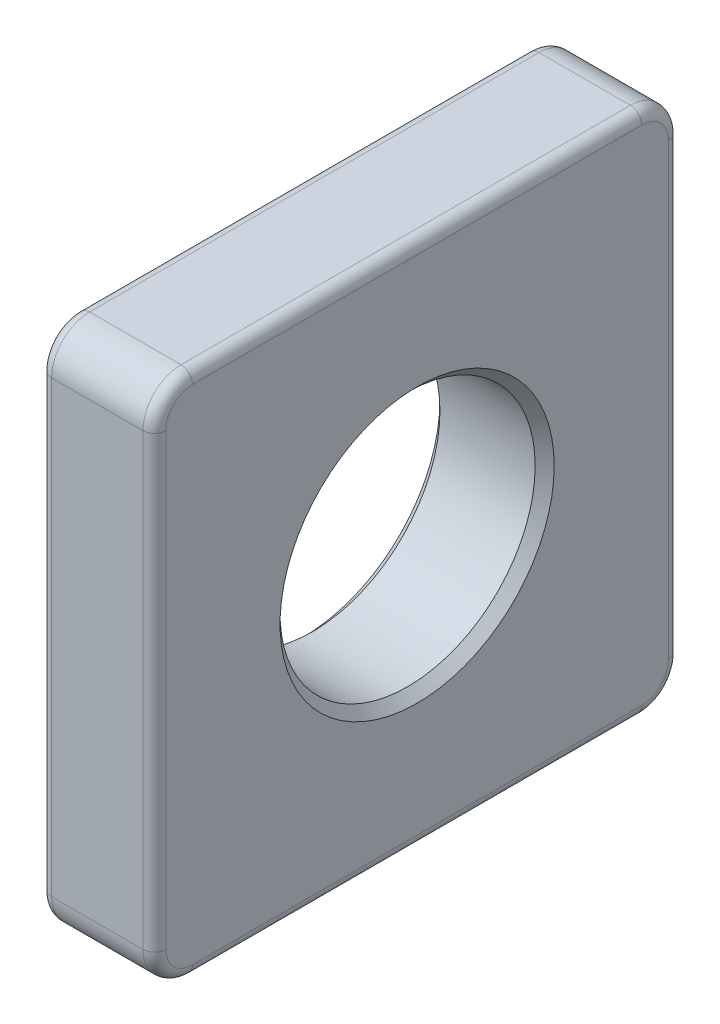
ISO-10303-21;
HEADER;
FILE_DESCRIPTION(('STEP AP214'),'2;1');
FILE_NAME('part.step','',(''),(''),'','','');
FILE_SCHEMA(('AUTOMOTIVE_DESIGN { 1 0 10303 214 1 1 1 1 }'));
ENDSEC;
DATA;
#1=APPLICATION_CONTEXT('core data for automotive mechanical design processes');
#2=APPLICATION_PROTOCOL_DEFINITION('international standard','automotive_design',2000,#1);
#3=PRODUCT_CONTEXT('',#1,'mechanical');
#4=PRODUCT('Part','Part','',(#3));
#5=PRODUCT_RELATED_PRODUCT_CATEGORY('part','',(#4));
#6=PRODUCT_DEFINITION_FORMATION('','',#4);
#7=PRODUCT_DEFINITION_CONTEXT('part definition',#1,'design');
#8=PRODUCT_DEFINITION('design','',#6,#7);
#9=PRODUCT_DEFINITION_SHAPE('','',#8);
#10=(LENGTH_UNIT() NAMED_UNIT(*) SI_UNIT(.MILLI.,.METRE.));
#11=(NAMED_UNIT(*) PLANE_ANGLE_UNIT() SI_UNIT($,.RADIAN.));
#12=(NAMED_UNIT(*) SI_UNIT($,.STERADIAN.) SOLID_ANGLE_UNIT());
#13=UNCERTAINTY_MEASURE_WITH_UNIT(LENGTH_MEASURE(1.E-05),#10,'distance_accuracy_value','');
#14=(GEOMETRIC_REPRESENTATION_CONTEXT(3) GLOBAL_UNCERTAINTY_ASSIGNED_CONTEXT((#13)) GLOBAL_UNIT_ASSIGNED_CONTEXT((#10,
#11,#12)) REPRESENTATION_CONTEXT('',''));
#15=CARTESIAN_POINT('',(0.,0.,0.));
#16=DIRECTION('',(0.,0.,1.));
#17=DIRECTION('',(1.,0.,0.));
#18=AXIS2_PLACEMENT_3D('',#15,#16,#17);
#19=CARTESIAN_POINT('',(3.,-6.9,6.9));
#20=DIRECTION('',(0.,0.,-1.));
#21=DIRECTION('',(-1.,0.,0.));
#22=AXIS2_PLACEMENT_3D('',#19,#20,#21);
#23=PLANE('',#22);
#24=DIRECTION('',(-1.,0.,0.));
#25=VECTOR('',#24,1.);
#26=CARTESIAN_POINT('',(3.,-5.9,6.9));
#27=LINE('',#26,#25);
#28=CARTESIAN_POINT('',(0.3,-5.9,6.9));
#29=VERTEX_POINT('',#28);
#30=CARTESIAN_POINT('',(2.7,-5.9,6.9));
#31=VERTEX_POINT('',#30);
#32=EDGE_CURVE('E187',#29,#31,#27,.F.);
#33=ORIENTED_EDGE('',*,*,#32,.T.);
#34=DIRECTION('',(0.,-1.,0.));
#35=VECTOR('',#34,1.);
#36=CARTESIAN_POINT('',(2.7,5.9,6.9));
#37=LINE('',#36,#35);
#38=CARTESIAN_POINT('',(2.7,5.9,6.9));
#39=VERTEX_POINT('',#38);
#40=EDGE_CURVE('E11',#31,#39,#37,.F.);
#41=ORIENTED_EDGE('',*,*,#40,.T.);
#42=DIRECTION('',(-1.,0.,0.));
#43=VECTOR('',#42,1.);
#44=CARTESIAN_POINT('',(3.,5.9,6.9));
#45=LINE('',#44,#43);
#46=CARTESIAN_POINT('',(0.3,5.9,6.9));
#47=VERTEX_POINT('',#46);
#48=EDGE_CURVE('E191',#39,#47,#45,.T.);
#49=ORIENTED_EDGE('',*,*,#48,.T.);
#50=DIRECTION('',(0.,-1.,0.));
#51=VECTOR('',#50,1.);
#52=CARTESIAN_POINT('',(0.3,-6.9,6.9));
#53=LINE('',#52,#51);
#54=EDGE_CURVE('E53',#47,#29,#53,.T.);
#55=ORIENTED_EDGE('',*,*,#54,.T.);
#56=EDGE_LOOP('',(#33,#41,#49,#55));
#57=FACE_BOUND('',#56,.T.);
#58=ADVANCED_FACE('F43',(#57),#23,.F.);
#59=CARTESIAN_POINT('',(3.,-6.9,-6.9));
#60=DIRECTION('',(0.,1.,0.));
#61=DIRECTION('',(0.,0.,1.));
#62=AXIS2_PLACEMENT_3D('',#59,#60,#61);
#63=PLANE('',#62);
#64=DIRECTION('',(-1.,0.,0.));
#65=VECTOR('',#64,1.);
#66=CARTESIAN_POINT('',(3.,-6.9,5.9));
#67=LINE('',#66,#65);
#68=CARTESIAN_POINT('',(2.7,-6.9,5.9));
#69=VERTEX_POINT('',#68);
#70=CARTESIAN_POINT('',(0.3,-6.9,5.9));
#71=VERTEX_POINT('',#70);
#72=EDGE_CURVE('E356',#69,#71,#67,.T.);
#73=ORIENTED_EDGE('',*,*,#72,.T.);
#74=DIRECTION('',(0.,0.,-1.));
#75=VECTOR('',#74,1.);
#76=CARTESIAN_POINT('',(0.3,-6.9,-6.9));
#77=LINE('',#76,#75);
#78=CARTESIAN_POINT('',(0.3,-6.9,-5.9));
#79=VERTEX_POINT('',#78);
#80=EDGE_CURVE('E246',#71,#79,#77,.T.);
#81=ORIENTED_EDGE('',*,*,#80,.T.);
#82=DIRECTION('',(-1.,0.,0.));
#83=VECTOR('',#82,1.);
#84=CARTESIAN_POINT('',(3.,-6.9,-5.9));
#85=LINE('',#84,#83);
#86=CARTESIAN_POINT('',(2.7,-6.9,-5.9));
#87=VERTEX_POINT('',#86);
#88=EDGE_CURVE('E362',#79,#87,#85,.F.);
#89=ORIENTED_EDGE('',*,*,#88,.T.);
#90=DIRECTION('',(0.,0.,-1.));
#91=VECTOR('',#90,1.);
#92=CARTESIAN_POINT('',(2.7,-6.9,5.9));
#93=LINE('',#92,#91);
#94=EDGE_CURVE('E243',#87,#69,#93,.F.);
#95=ORIENTED_EDGE('',*,*,#94,.T.);
#96=EDGE_LOOP('',(#73,#81,#89,#95));
#97=FACE_BOUND('',#96,.T.);
#98=ADVANCED_FACE('F404',(#97),#63,.F.);
#99=CARTESIAN_POINT('',(3.,-6.9,-6.9));
#100=DIRECTION('',(0.,0.,1.));
#101=DIRECTION('',(1.,0.,0.));
#102=AXIS2_PLACEMENT_3D('',#99,#100,#101);
#103=PLANE('',#102);
#104=DIRECTION('',(-1.,0.,0.));
#105=VECTOR('',#104,1.);
#106=CARTESIAN_POINT('',(3.,-5.9,-6.9));
#107=LINE('',#106,#105);
#108=CARTESIAN_POINT('',(2.7,-5.9,-6.9));
#109=VERTEX_POINT('',#108);
#110=CARTESIAN_POINT('',(0.3,-5.9,-6.9));
#111=VERTEX_POINT('',#110);
#112=EDGE_CURVE('E357',#109,#111,#107,.T.);
#113=ORIENTED_EDGE('',*,*,#112,.T.);
#114=DIRECTION('',(0.,1.,0.));
#115=VECTOR('',#114,1.);
#116=CARTESIAN_POINT('',(0.3,-6.9,-6.9));
#117=LINE('',#116,#115);
#118=CARTESIAN_POINT('',(0.3,5.9,-6.9));
#119=VERTEX_POINT('',#118);
#120=EDGE_CURVE('E234',#111,#119,#117,.T.);
#121=ORIENTED_EDGE('',*,*,#120,.T.);
#122=DIRECTION('',(-1.,0.,0.));
#123=VECTOR('',#122,1.);
#124=CARTESIAN_POINT('',(3.,5.9,-6.9));
#125=LINE('',#124,#123);
#126=CARTESIAN_POINT('',(2.7,5.9,-6.9));
#127=VERTEX_POINT('',#126);
#128=EDGE_CURVE('E346',#119,#127,#125,.F.);
#129=ORIENTED_EDGE('',*,*,#128,.T.);
#130=DIRECTION('',(0.,1.,0.));
#131=VECTOR('',#130,1.);
#132=CARTESIAN_POINT('',(2.7,-5.9,-6.9));
#133=LINE('',#132,#131);
#134=EDGE_CURVE('E231',#127,#109,#133,.F.);
#135=ORIENTED_EDGE('',*,*,#134,.T.);
#136=EDGE_LOOP('',(#113,#121,#129,#135));
#137=FACE_BOUND('',#136,.T.);
#138=ADVANCED_FACE('F352',(#137),#103,.F.);
#139=CARTESIAN_POINT('',(3.,6.9,-6.9));
#140=DIRECTION('',(0.,-1.,0.));
#141=DIRECTION('',(0.,0.,-1.));
#142=AXIS2_PLACEMENT_3D('',#139,#140,#141);
#143=PLANE('',#142);
#144=DIRECTION('',(-1.,0.,0.));
#145=VECTOR('',#144,1.);
#146=CARTESIAN_POINT('',(3.,6.9,-5.9));
#147=LINE('',#146,#145);
#148=CARTESIAN_POINT('',(2.7,6.9,-5.9));
#149=VERTEX_POINT('',#148);
#150=CARTESIAN_POINT('',(0.3,6.9,-5.9));
#151=VERTEX_POINT('',#150);
#152=EDGE_CURVE('E349',#149,#151,#147,.T.);
#153=ORIENTED_EDGE('',*,*,#152,.T.);
#154=DIRECTION('',(0.,0.,1.));
#155=VECTOR('',#154,1.);
#156=CARTESIAN_POINT('',(0.3,6.9,-6.9));
#157=LINE('',#156,#155);
#158=CARTESIAN_POINT('',(0.3,6.9,5.9));
#159=VERTEX_POINT('',#158);
#160=EDGE_CURVE('E222',#151,#159,#157,.T.);
#161=ORIENTED_EDGE('',*,*,#160,.T.);
#162=DIRECTION('',(-1.,0.,0.));
#163=VECTOR('',#162,1.);
#164=CARTESIAN_POINT('',(3.,6.9,5.9));
#165=LINE('',#164,#163);
#166=CARTESIAN_POINT('',(2.7,6.9,5.9));
#167=VERTEX_POINT('',#166);
#168=EDGE_CURVE('E630',#159,#167,#165,.F.);
#169=ORIENTED_EDGE('',*,*,#168,.T.);
#170=DIRECTION('',(0.,0.,1.));
#171=VECTOR('',#170,1.);
#172=CARTESIAN_POINT('',(2.7,6.9,-5.9));
#173=LINE('',#172,#171);
#174=EDGE_CURVE('E219',#167,#149,#173,.F.);
#175=ORIENTED_EDGE('',*,*,#174,.T.);
#176=EDGE_LOOP('',(#153,#161,#169,#175));
#177=FACE_BOUND('',#176,.T.);
#178=ADVANCED_FACE('F629',(#177),#143,.F.);
#179=CARTESIAN_POINT('',(3.,0.,0.));
#180=DIRECTION('',(1.,0.,0.));
#181=DIRECTION('',(0.,0.,-1.));
#182=AXIS2_PLACEMENT_3D('',#179,#180,#181);
#183=PLANE('',#182);
#184=DIRECTION('',(0.,-1.,0.));
#185=VECTOR('',#184,1.);
#186=CARTESIAN_POINT('',(3.,-5.9,6.6));
#187=LINE('',#186,#185);
#188=CARTESIAN_POINT('',(3.,5.9,6.6));
#189=VERTEX_POINT('',#188);
#190=CARTESIAN_POINT('',(3.,-5.9,6.6));
#191=VERTEX_POINT('',#190);
#192=EDGE_CURVE('E61',#189,#191,#187,.T.);
#193=ORIENTED_EDGE('',*,*,#192,.T.);
#194=CARTESIAN_POINT('',(3.,-5.9,5.9));
#195=DIRECTION('',(1.,0.,0.));
#196=DIRECTION('',(0.,0.,-1.));
#197=AXIS2_PLACEMENT_3D('',#194,#195,#196);
#198=CIRCLE('',#197,0.7);
#199=CARTESIAN_POINT('',(3.,-6.6,5.9));
#200=VERTEX_POINT('',#199);
#201=EDGE_CURVE('E274',#191,#200,#198,.T.);
#202=ORIENTED_EDGE('',*,*,#201,.T.);
#203=DIRECTION('',(0.,0.,-1.));
#204=VECTOR('',#203,1.);
#205=CARTESIAN_POINT('',(3.,-6.6,-5.9));
#206=LINE('',#205,#204);
#207=CARTESIAN_POINT('',(3.,-6.6,-5.9));
#208=VERTEX_POINT('',#207);
#209=EDGE_CURVE('E255',#200,#208,#206,.T.);
#210=ORIENTED_EDGE('',*,*,#209,.T.);
#211=CARTESIAN_POINT('',(3.,-5.9,-5.9));
#212=DIRECTION('',(1.,0.,0.));
#213=DIRECTION('',(0.,0.,-1.));
#214=AXIS2_PLACEMENT_3D('',#211,#212,#213);
#215=CIRCLE('',#214,0.7);
#216=CARTESIAN_POINT('',(3.,-5.9,-6.6));
#217=VERTEX_POINT('',#216);
#218=EDGE_CURVE('E258',#208,#217,#215,.T.);
#219=ORIENTED_EDGE('',*,*,#218,.T.);
#220=DIRECTION('',(0.,1.,0.));
#221=VECTOR('',#220,1.);
#222=CARTESIAN_POINT('',(3.,5.9,-6.6));
#223=LINE('',#222,#221);
#224=CARTESIAN_POINT('',(3.,5.9,-6.6));
#225=VERTEX_POINT('',#224);
#226=EDGE_CURVE('E261',#217,#225,#223,.T.);
#227=ORIENTED_EDGE('',*,*,#226,.T.);
#228=CARTESIAN_POINT('',(3.,5.9,-5.9));
#229=DIRECTION('',(1.,0.,0.));
#230=DIRECTION('',(0.,0.,-1.));
#231=AXIS2_PLACEMENT_3D('',#228,#229,#230);
#232=CIRCLE('',#231,0.7);
#233=CARTESIAN_POINT('',(3.,6.6,-5.9));
#234=VERTEX_POINT('',#233);
#235=EDGE_CURVE('E264',#225,#234,#232,.T.);
#236=ORIENTED_EDGE('',*,*,#235,.T.);
#237=DIRECTION('',(0.,0.,1.));
#238=VECTOR('',#237,1.);
#239=CARTESIAN_POINT('',(3.,6.6,5.9));
#240=LINE('',#239,#238);
#241=CARTESIAN_POINT('',(3.,6.6,5.9));
#242=VERTEX_POINT('',#241);
#243=EDGE_CURVE('E267',#234,#242,#240,.T.);
#244=ORIENTED_EDGE('',*,*,#243,.T.);
#245=CARTESIAN_POINT('',(3.,5.9,5.9));
#246=DIRECTION('',(1.,0.,0.));
#247=DIRECTION('',(0.,0.,-1.));
#248=AXIS2_PLACEMENT_3D('',#245,#246,#247);
#249=CIRCLE('',#248,0.7);
#250=EDGE_CURVE('E66',#242,#189,#249,.T.);
#251=ORIENTED_EDGE('',*,*,#250,.T.);
#252=EDGE_LOOP('',(#193,#202,#210,#219,#227,#236,#244,#251));
#253=FACE_BOUND('',#252,.T.);
#254=CARTESIAN_POINT('',(3.,0.,0.));
#255=DIRECTION('',(1.,0.,0.));
#256=DIRECTION('',(0.,0.,-1.));
#257=AXIS2_PLACEMENT_3D('',#254,#255,#256);
#258=CIRCLE('',#257,3.6);
#259=CARTESIAN_POINT('',(3.,0.,-3.6));
#260=VERTEX_POINT('',#259);
#261=EDGE_CURVE('E632',#260,#260,#258,.F.);
#262=ORIENTED_EDGE('',*,*,#261,.T.);
#263=EDGE_LOOP('',(#262));
#264=FACE_BOUND('',#263,.T.);
#265=ADVANCED_FACE('F391',(#253,#264),#183,.T.);
#266=CARTESIAN_POINT('',(0.,0.,0.));
#267=DIRECTION('',(1.,0.,0.));
#268=DIRECTION('',(0.,0.,-1.));
#269=AXIS2_PLACEMENT_3D('',#266,#267,#268);
#270=PLANE('',#269);
#271=DIRECTION('',(0.,-1.,0.));
#272=VECTOR('',#271,1.);
#273=CARTESIAN_POINT('',(0.,0.,6.6));
#274=LINE('',#273,#272);
#275=CARTESIAN_POINT('',(0.,-5.9,6.6));
#276=VERTEX_POINT('',#275);
#277=CARTESIAN_POINT('',(0.,5.9,6.6));
#278=VERTEX_POINT('',#277);
#279=EDGE_CURVE('E163',#276,#278,#274,.F.);
#280=ORIENTED_EDGE('',*,*,#279,.T.);
#281=CARTESIAN_POINT('',(0.,5.9,5.9));
#282=DIRECTION('',(1.,0.,0.));
#283=DIRECTION('',(0.,0.,-1.));
#284=AXIS2_PLACEMENT_3D('',#281,#282,#283);
#285=CIRCLE('',#284,0.7);
#286=CARTESIAN_POINT('',(0.,6.6,5.9));
#287=VERTEX_POINT('',#286);
#288=EDGE_CURVE('E209',#278,#287,#285,.F.);
#289=ORIENTED_EDGE('',*,*,#288,.T.);
#290=DIRECTION('',(0.,0.,1.));
#291=VECTOR('',#290,1.);
#292=CARTESIAN_POINT('',(0.,6.6,0.));
#293=LINE('',#292,#291);
#294=CARTESIAN_POINT('',(0.,6.6,-5.9));
#295=VERTEX_POINT('',#294);
#296=EDGE_CURVE('E206',#287,#295,#293,.F.);
#297=ORIENTED_EDGE('',*,*,#296,.T.);
#298=CARTESIAN_POINT('',(0.,5.9,-5.9));
#299=DIRECTION('',(1.,0.,0.));
#300=DIRECTION('',(0.,0.,-1.));
#301=AXIS2_PLACEMENT_3D('',#298,#299,#300);
#302=CIRCLE('',#301,0.7);
#303=CARTESIAN_POINT('',(0.,5.9,-6.6));
#304=VERTEX_POINT('',#303);
#305=EDGE_CURVE('E203',#295,#304,#302,.F.);
#306=ORIENTED_EDGE('',*,*,#305,.T.);
#307=DIRECTION('',(0.,1.,0.));
#308=VECTOR('',#307,1.);
#309=CARTESIAN_POINT('',(0.,0.,-6.6));
#310=LINE('',#309,#308);
#311=CARTESIAN_POINT('',(0.,-5.9,-6.6));
#312=VERTEX_POINT('',#311);
#313=EDGE_CURVE('E200',#304,#312,#310,.F.);
#314=ORIENTED_EDGE('',*,*,#313,.T.);
#315=CARTESIAN_POINT('',(0.,-5.9,-5.9));
#316=DIRECTION('',(1.,0.,0.));
#317=DIRECTION('',(0.,0.,-1.));
#318=AXIS2_PLACEMENT_3D('',#315,#316,#317);
#319=CIRCLE('',#318,0.7);
#320=CARTESIAN_POINT('',(0.,-6.6,-5.9));
#321=VERTEX_POINT('',#320);
#322=EDGE_CURVE('E197',#312,#321,#319,.F.);
#323=ORIENTED_EDGE('',*,*,#322,.T.);
#324=DIRECTION('',(0.,0.,-1.));
#325=VECTOR('',#324,1.);
#326=CARTESIAN_POINT('',(0.,-6.6,0.));
#327=LINE('',#326,#325);
#328=CARTESIAN_POINT('',(0.,-6.6,5.9));
#329=VERTEX_POINT('',#328);
#330=EDGE_CURVE('E166',#321,#329,#327,.F.);
#331=ORIENTED_EDGE('',*,*,#330,.T.);
#332=CARTESIAN_POINT('',(0.,-5.9,5.9));
#333=DIRECTION('',(1.,0.,0.));
#334=DIRECTION('',(0.,0.,-1.));
#335=AXIS2_PLACEMENT_3D('',#332,#333,#334);
#336=CIRCLE('',#335,0.7);
#337=EDGE_CURVE('E157',#329,#276,#336,.F.);
#338=ORIENTED_EDGE('',*,*,#337,.T.);
#339=EDGE_LOOP('',(#280,#289,#297,#306,#314,#323,#331,#338));
#340=FACE_BOUND('',#339,.T.);
#341=CARTESIAN_POINT('',(0.,0.,0.));
#342=DIRECTION('',(1.,0.,0.));
#343=DIRECTION('',(0.,0.,-1.));
#344=AXIS2_PLACEMENT_3D('',#341,#342,#343);
#345=CIRCLE('',#344,3.6);
#346=CARTESIAN_POINT('',(0.,0.,-3.6));
#347=VERTEX_POINT('',#346);
#348=EDGE_CURVE('E301',#347,#347,#345,.T.);
#349=ORIENTED_EDGE('',*,*,#348,.T.);
#350=EDGE_LOOP('',(#349));
#351=FACE_BOUND('',#350,.T.);
#352=ADVANCED_FACE('F159',(#340,#351),#270,.F.);
#353=CARTESIAN_POINT('',(3.,0.,0.));
#354=DIRECTION('',(-1.,0.,0.));
#355=DIRECTION('',(0.,0.,1.));
#356=AXIS2_PLACEMENT_3D('',#353,#354,#355);
#357=CYLINDRICAL_SURFACE('',#356,3.35);
#358=CARTESIAN_POINT('',(0.249999999999999,0.,0.));
#359=DIRECTION('',(1.,0.,0.));
#360=DIRECTION('',(0.,0.,-1.));
#361=AXIS2_PLACEMENT_3D('',#358,#359,#360);
#362=CIRCLE('',#361,3.35);
#363=CARTESIAN_POINT('',(0.249999999999999,0.,-3.35));
#364=VERTEX_POINT('',#363);
#365=EDGE_CURVE('E637',#364,#364,#362,.F.);
#366=ORIENTED_EDGE('',*,*,#365,.T.);
#367=EDGE_LOOP('',(#366));
#368=FACE_BOUND('',#367,.T.);
#369=CARTESIAN_POINT('',(2.75,0.,0.));
#370=DIRECTION('',(1.,0.,0.));
#371=DIRECTION('',(0.,0.,-1.));
#372=AXIS2_PLACEMENT_3D('',#369,#370,#371);
#373=CIRCLE('',#372,3.35);
#374=CARTESIAN_POINT('',(2.75,0.,-3.35));
#375=VERTEX_POINT('',#374);
#376=EDGE_CURVE('E643',#375,#375,#373,.T.);
#377=ORIENTED_EDGE('',*,*,#376,.T.);
#378=EDGE_LOOP('',(#377));
#379=FACE_BOUND('',#378,.T.);
#380=ADVANCED_FACE('F436',(#368,#379),#357,.F.);
#381=CARTESIAN_POINT('',(0.,0.,0.));
#382=DIRECTION('',(-1.,0.,0.));
#383=DIRECTION('',(0.,0.,1.));
#384=AXIS2_PLACEMENT_3D('',#381,#382,#383);
#385=CONICAL_SURFACE('',#384,3.6,0.785398163397444);
#386=ORIENTED_EDGE('',*,*,#365,.F.);
#387=EDGE_LOOP('',(#386));
#388=FACE_BOUND('',#387,.T.);
#389=ORIENTED_EDGE('',*,*,#348,.F.);
#390=EDGE_LOOP('',(#389));
#391=FACE_BOUND('',#390,.T.);
#392=ADVANCED_FACE('F429',(#388,#391),#385,.F.);
#393=CARTESIAN_POINT('',(2.75,0.,0.));
#394=DIRECTION('',(1.,0.,0.));
#395=DIRECTION('',(0.,0.,-1.));
#396=AXIS2_PLACEMENT_3D('',#393,#394,#395);
#397=CONICAL_SURFACE('',#396,3.35,0.785398163397456);
#398=ORIENTED_EDGE('',*,*,#261,.F.);
#399=EDGE_LOOP('',(#398));
#400=FACE_BOUND('',#399,.T.);
#401=ORIENTED_EDGE('',*,*,#376,.F.);
#402=EDGE_LOOP('',(#401));
#403=FACE_BOUND('',#402,.T.);
#404=ADVANCED_FACE('F435',(#400,#403),#397,.F.);
#405=CARTESIAN_POINT('',(3.,5.9,-5.9));
#406=DIRECTION('',(-1.,0.,0.));
#407=DIRECTION('',(0.,0.,1.));
#408=AXIS2_PLACEMENT_3D('',#405,#406,#407);
#409=CYLINDRICAL_SURFACE('',#408,1.);
#410=ORIENTED_EDGE('',*,*,#128,.F.);
#411=CARTESIAN_POINT('',(0.3,5.9,-5.9));
#412=DIRECTION('',(1.,0.,0.));
#413=DIRECTION('',(0.,0.,-1.));
#414=AXIS2_PLACEMENT_3D('',#411,#412,#413);
#415=CIRCLE('',#414,1.);
#416=EDGE_CURVE('E228',#119,#151,#415,.T.);
#417=ORIENTED_EDGE('',*,*,#416,.T.);
#418=ORIENTED_EDGE('',*,*,#152,.F.);
#419=CARTESIAN_POINT('',(2.7,5.9,-5.9));
#420=DIRECTION('',(1.,0.,0.));
#421=DIRECTION('',(0.,0.,-1.));
#422=AXIS2_PLACEMENT_3D('',#419,#420,#421);
#423=CIRCLE('',#422,1.);
#424=EDGE_CURVE('E225',#149,#127,#423,.F.);
#425=ORIENTED_EDGE('',*,*,#424,.T.);
#426=EDGE_LOOP('',(#410,#417,#418,#425));
#427=FACE_BOUND('',#426,.T.);
#428=ADVANCED_FACE('F345',(#427),#409,.T.);
#429=CARTESIAN_POINT('',(3.,-5.9,-5.9));
#430=DIRECTION('',(-1.,0.,0.));
#431=DIRECTION('',(0.,0.,1.));
#432=AXIS2_PLACEMENT_3D('',#429,#430,#431);
#433=CYLINDRICAL_SURFACE('',#432,1.);
#434=ORIENTED_EDGE('',*,*,#88,.F.);
#435=CARTESIAN_POINT('',(0.3,-5.9,-5.9));
#436=DIRECTION('',(1.,0.,0.));
#437=DIRECTION('',(0.,0.,-1.));
#438=AXIS2_PLACEMENT_3D('',#435,#436,#437);
#439=CIRCLE('',#438,1.);
#440=EDGE_CURVE('E240',#79,#111,#439,.T.);
#441=ORIENTED_EDGE('',*,*,#440,.T.);
#442=ORIENTED_EDGE('',*,*,#112,.F.);
#443=CARTESIAN_POINT('',(2.7,-5.9,-5.9));
#444=DIRECTION('',(1.,0.,0.));
#445=DIRECTION('',(0.,0.,-1.));
#446=AXIS2_PLACEMENT_3D('',#443,#444,#445);
#447=CIRCLE('',#446,1.);
#448=EDGE_CURVE('E237',#109,#87,#447,.F.);
#449=ORIENTED_EDGE('',*,*,#448,.T.);
#450=EDGE_LOOP('',(#434,#441,#442,#449));
#451=FACE_BOUND('',#450,.T.);
#452=ADVANCED_FACE('F410',(#451),#433,.T.);
#453=CARTESIAN_POINT('',(3.,-5.9,5.9));
#454=DIRECTION('',(-1.,0.,0.));
#455=DIRECTION('',(0.,0.,1.));
#456=AXIS2_PLACEMENT_3D('',#453,#454,#455);
#457=CYLINDRICAL_SURFACE('',#456,1.);
#458=ORIENTED_EDGE('',*,*,#32,.F.);
#459=CARTESIAN_POINT('',(0.3,-5.9,5.9));
#460=DIRECTION('',(1.,0.,0.));
#461=DIRECTION('',(0.,0.,-1.));
#462=AXIS2_PLACEMENT_3D('',#459,#460,#461);
#463=CIRCLE('',#462,1.);
#464=EDGE_CURVE('E176',#29,#71,#463,.T.);
#465=ORIENTED_EDGE('',*,*,#464,.T.);
#466=ORIENTED_EDGE('',*,*,#72,.F.);
#467=CARTESIAN_POINT('',(2.7,-5.9,5.9));
#468=DIRECTION('',(1.,0.,0.));
#469=DIRECTION('',(0.,0.,-1.));
#470=AXIS2_PLACEMENT_3D('',#467,#468,#469);
#471=CIRCLE('',#470,1.);
#472=EDGE_CURVE('E249',#69,#31,#471,.F.);
#473=ORIENTED_EDGE('',*,*,#472,.T.);
#474=EDGE_LOOP('',(#458,#465,#466,#473));
#475=FACE_BOUND('',#474,.T.);
#476=ADVANCED_FACE('F408',(#475),#457,.T.);
#477=CARTESIAN_POINT('',(3.,5.9,5.9));
#478=DIRECTION('',(-1.,0.,0.));
#479=DIRECTION('',(0.,0.,1.));
#480=AXIS2_PLACEMENT_3D('',#477,#478,#479);
#481=CYLINDRICAL_SURFACE('',#480,1.);
#482=ORIENTED_EDGE('',*,*,#168,.F.);
#483=CARTESIAN_POINT('',(0.3,5.9,5.9));
#484=DIRECTION('',(1.,0.,0.));
#485=DIRECTION('',(0.,0.,-1.));
#486=AXIS2_PLACEMENT_3D('',#483,#484,#485);
#487=CIRCLE('',#486,1.);
#488=EDGE_CURVE('E215',#159,#47,#487,.T.);
#489=ORIENTED_EDGE('',*,*,#488,.T.);
#490=ORIENTED_EDGE('',*,*,#48,.F.);
#491=CARTESIAN_POINT('',(2.7,5.9,5.9));
#492=DIRECTION('',(1.,0.,0.));
#493=DIRECTION('',(0.,0.,-1.));
#494=AXIS2_PLACEMENT_3D('',#491,#492,#493);
#495=CIRCLE('',#494,1.);
#496=EDGE_CURVE('E212',#39,#167,#495,.F.);
#497=ORIENTED_EDGE('',*,*,#496,.T.);
#498=EDGE_LOOP('',(#482,#489,#490,#497));
#499=FACE_BOUND('',#498,.T.);
#500=ADVANCED_FACE('F378',(#499),#481,.T.);
#501=CARTESIAN_POINT('',(0.3,-5.9,-5.9));
#502=DIRECTION('',(1.,0.,0.));
#503=DIRECTION('',(0.,0.,-1.));
#504=AXIS2_PLACEMENT_3D('',#501,#502,#503);
#505=TOROIDAL_SURFACE('',#504,0.7,0.3);
#506=CARTESIAN_POINT('',(0.3,-5.9,-6.6));
#507=DIRECTION('',(0.,1.,0.));
#508=DIRECTION('',(0.,0.,1.));
#509=AXIS2_PLACEMENT_3D('',#506,#507,#508);
#510=CIRCLE('',#509,0.3);
#511=EDGE_CURVE('E293',#111,#312,#510,.T.);
#512=ORIENTED_EDGE('',*,*,#511,.F.);
#513=ORIENTED_EDGE('',*,*,#440,.F.);
#514=CARTESIAN_POINT('',(0.3,-6.6,-5.9));
#515=DIRECTION('',(0.,0.,1.));
#516=DIRECTION('',(1.,0.,0.));
#517=AXIS2_PLACEMENT_3D('',#514,#515,#516);
#518=CIRCLE('',#517,0.3);
#519=EDGE_CURVE('E297',#321,#79,#518,.T.);
#520=ORIENTED_EDGE('',*,*,#519,.F.);
#521=ORIENTED_EDGE('',*,*,#322,.F.);
#522=EDGE_LOOP('',(#512,#513,#520,#521));
#523=FACE_BOUND('',#522,.T.);
#524=ADVANCED_FACE('F416',(#523),#505,.T.);
#525=CARTESIAN_POINT('',(0.3,-6.6,-6.9));
#526=DIRECTION('',(0.,0.,-1.));
#527=DIRECTION('',(0.,1.,0.));
#528=AXIS2_PLACEMENT_3D('',#525,#526,#527);
#529=CYLINDRICAL_SURFACE('',#528,0.3);
#530=ORIENTED_EDGE('',*,*,#519,.T.);
#531=ORIENTED_EDGE('',*,*,#80,.F.);
#532=CARTESIAN_POINT('',(0.3,-6.6,5.9));
#533=DIRECTION('',(0.,0.,1.));
#534=DIRECTION('',(1.,0.,0.));
#535=AXIS2_PLACEMENT_3D('',#532,#533,#534);
#536=CIRCLE('',#535,0.3);
#537=EDGE_CURVE('E290',#329,#71,#536,.T.);
#538=ORIENTED_EDGE('',*,*,#537,.F.);
#539=ORIENTED_EDGE('',*,*,#330,.F.);
#540=EDGE_LOOP('',(#530,#531,#538,#539));
#541=FACE_BOUND('',#540,.T.);
#542=ADVANCED_FACE('F472',(#541),#529,.T.);
#543=CARTESIAN_POINT('',(0.3,-6.9,-6.6));
#544=DIRECTION('',(0.,1.,0.));
#545=DIRECTION('',(0.,0.,1.));
#546=AXIS2_PLACEMENT_3D('',#543,#544,#545);
#547=CYLINDRICAL_SURFACE('',#546,0.3);
#548=ORIENTED_EDGE('',*,*,#511,.T.);
#549=ORIENTED_EDGE('',*,*,#313,.F.);
#550=CARTESIAN_POINT('',(0.3,5.9,-6.6));
#551=DIRECTION('',(0.,1.,0.));
#552=DIRECTION('',(0.,0.,1.));
#553=AXIS2_PLACEMENT_3D('',#550,#551,#552);
#554=CIRCLE('',#553,0.3);
#555=EDGE_CURVE('E180',#119,#304,#554,.T.);
#556=ORIENTED_EDGE('',*,*,#555,.F.);
#557=ORIENTED_EDGE('',*,*,#120,.F.);
#558=EDGE_LOOP('',(#548,#549,#556,#557));
#559=FACE_BOUND('',#558,.T.);
#560=ADVANCED_FACE('F483',(#559),#547,.T.);
#561=CARTESIAN_POINT('',(0.3,-5.9,5.9));
#562=DIRECTION('',(1.,0.,0.));
#563=DIRECTION('',(0.,0.,-1.));
#564=AXIS2_PLACEMENT_3D('',#561,#562,#563);
#565=TOROIDAL_SURFACE('',#564,0.7,0.3);
#566=ORIENTED_EDGE('',*,*,#537,.T.);
#567=ORIENTED_EDGE('',*,*,#464,.F.);
#568=CARTESIAN_POINT('',(0.3,-5.9,6.6));
#569=DIRECTION('',(0.,1.,0.));
#570=DIRECTION('',(0.,0.,1.));
#571=AXIS2_PLACEMENT_3D('',#568,#569,#570);
#572=CIRCLE('',#571,0.3);
#573=EDGE_CURVE('E174',#276,#29,#572,.T.);
#574=ORIENTED_EDGE('',*,*,#573,.F.);
#575=ORIENTED_EDGE('',*,*,#337,.F.);
#576=EDGE_LOOP('',(#566,#567,#574,#575));
#577=FACE_BOUND('',#576,.T.);
#578=ADVANCED_FACE('F175',(#577),#565,.T.);
#579=CARTESIAN_POINT('',(0.3,5.9,-5.9));
#580=DIRECTION('',(1.,0.,0.));
#581=DIRECTION('',(0.,0.,-1.));
#582=AXIS2_PLACEMENT_3D('',#579,#580,#581);
#583=TOROIDAL_SURFACE('',#582,0.7,0.3);
#584=ORIENTED_EDGE('',*,*,#555,.T.);
#585=ORIENTED_EDGE('',*,*,#305,.F.);
#586=CARTESIAN_POINT('',(0.3,6.6,-5.9));
#587=DIRECTION('',(0.,0.,1.));
#588=DIRECTION('',(1.,0.,0.));
#589=AXIS2_PLACEMENT_3D('',#586,#587,#588);
#590=CIRCLE('',#589,0.3);
#591=EDGE_CURVE('E181',#151,#295,#590,.T.);
#592=ORIENTED_EDGE('',*,*,#591,.F.);
#593=ORIENTED_EDGE('',*,*,#416,.F.);
#594=EDGE_LOOP('',(#584,#585,#592,#593));
#595=FACE_BOUND('',#594,.T.);
#596=ADVANCED_FACE('F502',(#595),#583,.T.);
#597=CARTESIAN_POINT('',(0.3,-6.9,6.6));
#598=DIRECTION('',(0.,-1.,0.));
#599=DIRECTION('',(0.,0.,-1.));
#600=AXIS2_PLACEMENT_3D('',#597,#598,#599);
#601=CYLINDRICAL_SURFACE('',#600,0.3);
#602=ORIENTED_EDGE('',*,*,#573,.T.);
#603=ORIENTED_EDGE('',*,*,#54,.F.);
#604=CARTESIAN_POINT('',(0.3,5.9,6.6));
#605=DIRECTION('',(0.,1.,0.));
#606=DIRECTION('',(0.,0.,1.));
#607=AXIS2_PLACEMENT_3D('',#604,#605,#606);
#608=CIRCLE('',#607,0.3);
#609=EDGE_CURVE('E184',#278,#47,#608,.T.);
#610=ORIENTED_EDGE('',*,*,#609,.F.);
#611=ORIENTED_EDGE('',*,*,#279,.F.);
#612=EDGE_LOOP('',(#602,#603,#610,#611));
#613=FACE_BOUND('',#612,.T.);
#614=ADVANCED_FACE('F183',(#613),#601,.T.);
#615=CARTESIAN_POINT('',(0.3,6.6,-6.9));
#616=DIRECTION('',(0.,0.,1.));
#617=DIRECTION('',(0.,-1.,0.));
#618=AXIS2_PLACEMENT_3D('',#615,#616,#617);
#619=CYLINDRICAL_SURFACE('',#618,0.3);
#620=ORIENTED_EDGE('',*,*,#591,.T.);
#621=ORIENTED_EDGE('',*,*,#296,.F.);
#622=CARTESIAN_POINT('',(0.3,6.6,5.9));
#623=DIRECTION('',(0.,0.,1.));
#624=DIRECTION('',(1.,0.,0.));
#625=AXIS2_PLACEMENT_3D('',#622,#623,#624);
#626=CIRCLE('',#625,0.3);
#627=EDGE_CURVE('E279',#159,#287,#626,.T.);
#628=ORIENTED_EDGE('',*,*,#627,.F.);
#629=ORIENTED_EDGE('',*,*,#160,.F.);
#630=EDGE_LOOP('',(#620,#621,#628,#629));
#631=FACE_BOUND('',#630,.T.);
#632=ADVANCED_FACE('F522',(#631),#619,.T.);
#633=CARTESIAN_POINT('',(0.3,5.9,5.9));
#634=DIRECTION('',(1.,0.,0.));
#635=DIRECTION('',(0.,0.,-1.));
#636=AXIS2_PLACEMENT_3D('',#633,#634,#635);
#637=TOROIDAL_SURFACE('',#636,0.7,0.3);
#638=ORIENTED_EDGE('',*,*,#609,.T.);
#639=ORIENTED_EDGE('',*,*,#488,.F.);
#640=ORIENTED_EDGE('',*,*,#627,.T.);
#641=ORIENTED_EDGE('',*,*,#288,.F.);
#642=EDGE_LOOP('',(#638,#639,#640,#641));
#643=FACE_BOUND('',#642,.T.);
#644=ADVANCED_FACE('F531',(#643),#637,.T.);
#645=CARTESIAN_POINT('',(2.7,5.9,-5.9));
#646=DIRECTION('',(1.,0.,0.));
#647=DIRECTION('',(0.,0.,-1.));
#648=AXIS2_PLACEMENT_3D('',#645,#646,#647);
#649=TOROIDAL_SURFACE('',#648,0.7,0.3);
#650=CARTESIAN_POINT('',(2.7,5.9,-6.6));
#651=DIRECTION('',(0.,-1.,0.));
#652=DIRECTION('',(0.,0.,-1.));
#653=AXIS2_PLACEMENT_3D('',#650,#651,#652);
#654=CIRCLE('',#653,0.3);
#655=EDGE_CURVE('E323',#127,#225,#654,.T.);
#656=ORIENTED_EDGE('',*,*,#655,.F.);
#657=ORIENTED_EDGE('',*,*,#424,.F.);
#658=CARTESIAN_POINT('',(2.7,6.6,-5.9));
#659=DIRECTION('',(0.,0.,1.));
#660=DIRECTION('',(1.,0.,0.));
#661=AXIS2_PLACEMENT_3D('',#658,#659,#660);
#662=CIRCLE('',#661,0.3);
#663=EDGE_CURVE('E47',#234,#149,#662,.T.);
#664=ORIENTED_EDGE('',*,*,#663,.F.);
#665=ORIENTED_EDGE('',*,*,#235,.F.);
#666=EDGE_LOOP('',(#656,#657,#664,#665));
#667=FACE_BOUND('',#666,.T.);
#668=ADVANCED_FACE('F45',(#667),#649,.T.);
#669=CARTESIAN_POINT('',(2.7,6.6,0.));
#670=DIRECTION('',(0.,0.,-1.));
#671=DIRECTION('',(0.,1.,0.));
#672=AXIS2_PLACEMENT_3D('',#669,#670,#671);
#673=CYLINDRICAL_SURFACE('',#672,0.3);
#674=ORIENTED_EDGE('',*,*,#663,.T.);
#675=ORIENTED_EDGE('',*,*,#174,.F.);
#676=CARTESIAN_POINT('',(2.7,6.6,5.9));
#677=DIRECTION('',(0.,0.,1.));
#678=DIRECTION('',(1.,0.,0.));
#679=AXIS2_PLACEMENT_3D('',#676,#677,#678);
#680=CIRCLE('',#679,0.3);
#681=EDGE_CURVE('E320',#242,#167,#680,.T.);
#682=ORIENTED_EDGE('',*,*,#681,.F.);
#683=ORIENTED_EDGE('',*,*,#243,.F.);
#684=EDGE_LOOP('',(#674,#675,#682,#683));
#685=FACE_BOUND('',#684,.T.);
#686=ADVANCED_FACE('F336',(#685),#673,.T.);
#687=CARTESIAN_POINT('',(2.7,0.,-6.6));
#688=DIRECTION('',(0.,-1.,0.));
#689=DIRECTION('',(0.,0.,-1.));
#690=AXIS2_PLACEMENT_3D('',#687,#688,#689);
#691=CYLINDRICAL_SURFACE('',#690,0.3);
#692=ORIENTED_EDGE('',*,*,#655,.T.);
#693=ORIENTED_EDGE('',*,*,#226,.F.);
#694=CARTESIAN_POINT('',(2.7,-5.9,-6.6));
#695=DIRECTION('',(0.,-1.,0.));
#696=DIRECTION('',(0.,0.,-1.));
#697=AXIS2_PLACEMENT_3D('',#694,#695,#696);
#698=CIRCLE('',#697,0.3);
#699=EDGE_CURVE('E316',#109,#217,#698,.T.);
#700=ORIENTED_EDGE('',*,*,#699,.F.);
#701=ORIENTED_EDGE('',*,*,#134,.F.);
#702=EDGE_LOOP('',(#692,#693,#700,#701));
#703=FACE_BOUND('',#702,.T.);
#704=ADVANCED_FACE('F559',(#703),#691,.T.);
#705=CARTESIAN_POINT('',(2.7,5.9,5.9));
#706=DIRECTION('',(1.,0.,0.));
#707=DIRECTION('',(0.,0.,-1.));
#708=AXIS2_PLACEMENT_3D('',#705,#706,#707);
#709=TOROIDAL_SURFACE('',#708,0.7,0.3);
#710=ORIENTED_EDGE('',*,*,#681,.T.);
#711=ORIENTED_EDGE('',*,*,#496,.F.);
#712=CARTESIAN_POINT('',(2.7,5.9,6.6));
#713=DIRECTION('',(0.,-1.,0.));
#714=DIRECTION('',(0.,0.,-1.));
#715=AXIS2_PLACEMENT_3D('',#712,#713,#714);
#716=CIRCLE('',#715,0.3);
#717=EDGE_CURVE('E312',#189,#39,#716,.T.);
#718=ORIENTED_EDGE('',*,*,#717,.F.);
#719=ORIENTED_EDGE('',*,*,#250,.F.);
#720=EDGE_LOOP('',(#710,#711,#718,#719));
#721=FACE_BOUND('',#720,.T.);
#722=ADVANCED_FACE('F382',(#721),#709,.T.);
#723=CARTESIAN_POINT('',(2.7,-5.9,-5.9));
#724=DIRECTION('',(1.,0.,0.));
#725=DIRECTION('',(0.,0.,-1.));
#726=AXIS2_PLACEMENT_3D('',#723,#724,#725);
#727=TOROIDAL_SURFACE('',#726,0.7,0.3);
#728=ORIENTED_EDGE('',*,*,#699,.T.);
#729=ORIENTED_EDGE('',*,*,#218,.F.);
#730=CARTESIAN_POINT('',(2.7,-6.6,-5.9));
#731=DIRECTION('',(0.,0.,1.));
#732=DIRECTION('',(1.,0.,0.));
#733=AXIS2_PLACEMENT_3D('',#730,#731,#732);
#734=CIRCLE('',#733,0.3);
#735=EDGE_CURVE('E308',#87,#208,#734,.T.);
#736=ORIENTED_EDGE('',*,*,#735,.F.);
#737=ORIENTED_EDGE('',*,*,#448,.F.);
#738=EDGE_LOOP('',(#728,#729,#736,#737));
#739=FACE_BOUND('',#738,.T.);
#740=ADVANCED_FACE('F397',(#739),#727,.T.);
#741=CARTESIAN_POINT('',(2.7,0.,6.6));
#742=DIRECTION('',(0.,1.,0.));
#743=DIRECTION('',(0.,0.,1.));
#744=AXIS2_PLACEMENT_3D('',#741,#742,#743);
#745=CYLINDRICAL_SURFACE('',#744,0.3);
#746=ORIENTED_EDGE('',*,*,#717,.T.);
#747=ORIENTED_EDGE('',*,*,#40,.F.);
#748=CARTESIAN_POINT('',(2.7,-5.9,6.6));
#749=DIRECTION('',(0.,-1.,0.));
#750=DIRECTION('',(0.,0.,-1.));
#751=AXIS2_PLACEMENT_3D('',#748,#749,#750);
#752=CIRCLE('',#751,0.3);
#753=EDGE_CURVE('E305',#191,#31,#752,.T.);
#754=ORIENTED_EDGE('',*,*,#753,.F.);
#755=ORIENTED_EDGE('',*,*,#192,.F.);
#756=EDGE_LOOP('',(#746,#747,#754,#755));
#757=FACE_BOUND('',#756,.T.);
#758=ADVANCED_FACE('F384',(#757),#745,.T.);
#759=CARTESIAN_POINT('',(2.7,-6.6,0.));
#760=DIRECTION('',(0.,0.,1.));
#761=DIRECTION('',(0.,-1.,0.));
#762=AXIS2_PLACEMENT_3D('',#759,#760,#761);
#763=CYLINDRICAL_SURFACE('',#762,0.3);
#764=ORIENTED_EDGE('',*,*,#735,.T.);
#765=ORIENTED_EDGE('',*,*,#209,.F.);
#766=CARTESIAN_POINT('',(2.7,-6.6,5.9));
#767=DIRECTION('',(0.,0.,1.));
#768=DIRECTION('',(1.,0.,0.));
#769=AXIS2_PLACEMENT_3D('',#766,#767,#768);
#770=CIRCLE('',#769,0.3);
#771=EDGE_CURVE('E302',#69,#200,#770,.T.);
#772=ORIENTED_EDGE('',*,*,#771,.F.);
#773=ORIENTED_EDGE('',*,*,#94,.F.);
#774=EDGE_LOOP('',(#764,#765,#772,#773));
#775=FACE_BOUND('',#774,.T.);
#776=ADVANCED_FACE('F401',(#775),#763,.T.);
#777=CARTESIAN_POINT('',(2.7,-5.9,5.9));
#778=DIRECTION('',(1.,0.,0.));
#779=DIRECTION('',(0.,0.,-1.));
#780=AXIS2_PLACEMENT_3D('',#777,#778,#779);
#781=TOROIDAL_SURFACE('',#780,0.7,0.3);
#782=ORIENTED_EDGE('',*,*,#753,.T.);
#783=ORIENTED_EDGE('',*,*,#472,.F.);
#784=ORIENTED_EDGE('',*,*,#771,.T.);
#785=ORIENTED_EDGE('',*,*,#201,.F.);
#786=EDGE_LOOP('',(#782,#783,#784,#785));
#787=FACE_BOUND('',#786,.T.);
#788=ADVANCED_FACE('F388',(#787),#781,.T.);
#789=CLOSED_SHELL('',(#58,#98,#138,#178,#265,#352,#380,#392,#404,#428,#452,#476,#500,#524,#542,
#560,#578,#596,#614,#632,#644,#668,#686,#704,#722,#740,#758,#776,#788));
#790=MANIFOLD_SOLID_BREP('B2',#789);
#791=ADVANCED_BREP_SHAPE_REPRESENTATION('',(#18,#790),#14);
#792=SHAPE_DEFINITION_REPRESENTATION(#9,#791);
ENDSEC;
END-ISO-10303-21;
